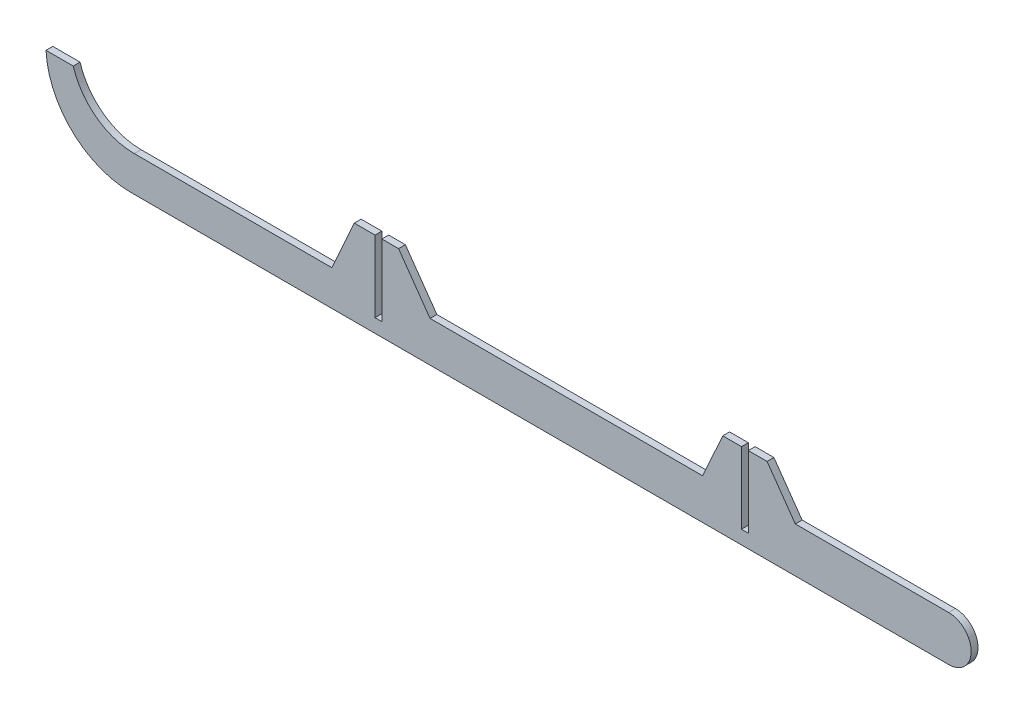
ISO-10303-21;
HEADER;
FILE_DESCRIPTION(('STEP AP214'),'2;1');
FILE_NAME('part.step','',(''),(''),'','','');
FILE_SCHEMA(('AUTOMOTIVE_DESIGN { 1 0 10303 214 1 1 1 1 }'));
ENDSEC;
DATA;
#1=APPLICATION_CONTEXT('core data for automotive mechanical design processes');
#2=APPLICATION_PROTOCOL_DEFINITION('international standard','automotive_design',2000,#1);
#3=PRODUCT_CONTEXT('',#1,'mechanical');
#4=PRODUCT('Part','Part','',(#3));
#5=PRODUCT_RELATED_PRODUCT_CATEGORY('part','',(#4));
#6=PRODUCT_DEFINITION_FORMATION('','',#4);
#7=PRODUCT_DEFINITION_CONTEXT('part definition',#1,'design');
#8=PRODUCT_DEFINITION('design','',#6,#7);
#9=PRODUCT_DEFINITION_SHAPE('','',#8);
#10=(LENGTH_UNIT() NAMED_UNIT(*) SI_UNIT(.MILLI.,.METRE.));
#11=(NAMED_UNIT(*) PLANE_ANGLE_UNIT() SI_UNIT($,.RADIAN.));
#12=(NAMED_UNIT(*) SI_UNIT($,.STERADIAN.) SOLID_ANGLE_UNIT());
#13=UNCERTAINTY_MEASURE_WITH_UNIT(LENGTH_MEASURE(1.E-05),#10,'distance_accuracy_value','');
#14=(GEOMETRIC_REPRESENTATION_CONTEXT(3) GLOBAL_UNCERTAINTY_ASSIGNED_CONTEXT((#13)) GLOBAL_UNIT_ASSIGNED_CONTEXT((#10,
#11,#12)) REPRESENTATION_CONTEXT('',''));
#15=CARTESIAN_POINT('',(0.,0.,0.));
#16=DIRECTION('',(0.,0.,1.));
#17=DIRECTION('',(1.,0.,0.));
#18=AXIS2_PLACEMENT_3D('',#15,#16,#17);
#19=CARTESIAN_POINT('',(78.9077012483061,6.62024351575315,2.));
#20=DIRECTION('',(0.,0.,-1.));
#21=DIRECTION('',(-1.,0.,0.));
#22=AXIS2_PLACEMENT_3D('',#19,#20,#21);
#23=CYLINDRICAL_SURFACE('',#22,6.62024351575315);
#24=CARTESIAN_POINT('',(78.9077012483061,6.62024351575315,0.));
#25=DIRECTION('',(0.,0.,1.));
#26=DIRECTION('',(-1.,0.,0.));
#27=AXIS2_PLACEMENT_3D('',#24,#25,#26);
#28=CIRCLE('',#27,6.62024351575315);
#29=CARTESIAN_POINT('',(78.9077012483061,0.,0.));
#30=VERTEX_POINT('',#29);
#31=CARTESIAN_POINT('',(78.9077012483061,13.2404870315063,0.));
#32=VERTEX_POINT('',#31);
#33=EDGE_CURVE('E216',#30,#32,#28,.T.);
#34=ORIENTED_EDGE('',*,*,#33,.T.);
#35=DIRECTION('',(0.,0.,-1.));
#36=VECTOR('',#35,1.);
#37=CARTESIAN_POINT('',(78.9077012483061,13.2404870315063,2.));
#38=LINE('',#37,#36);
#39=CARTESIAN_POINT('',(78.9077012483061,13.2404870315063,2.));
#40=VERTEX_POINT('',#39);
#41=EDGE_CURVE('E11',#40,#32,#38,.T.);
#42=ORIENTED_EDGE('',*,*,#41,.F.);
#43=CARTESIAN_POINT('',(78.9077012483061,6.62024351575315,2.));
#44=DIRECTION('',(0.,0.,1.));
#45=DIRECTION('',(-1.,0.,0.));
#46=AXIS2_PLACEMENT_3D('',#43,#44,#45);
#47=CIRCLE('',#46,6.62024351575315);
#48=CARTESIAN_POINT('',(78.9077012483061,0.,2.));
#49=VERTEX_POINT('',#48);
#50=EDGE_CURVE('E258',#49,#40,#47,.T.);
#51=ORIENTED_EDGE('',*,*,#50,.F.);
#52=DIRECTION('',(0.,0.,-1.));
#53=VECTOR('',#52,1.);
#54=CARTESIAN_POINT('',(78.9077012483061,0.,2.));
#55=LINE('',#54,#53);
#56=EDGE_CURVE('E212',#49,#30,#55,.T.);
#57=ORIENTED_EDGE('',*,*,#56,.T.);
#58=EDGE_LOOP('',(#34,#42,#51,#57));
#59=FACE_BOUND('',#58,.T.);
#60=ADVANCED_FACE('F36',(#59),#23,.T.);
#61=CARTESIAN_POINT('',(33.9077012483061,13.2404870315063,2.));
#62=DIRECTION('',(0.,-1.,0.));
#63=DIRECTION('',(0.,0.,-1.));
#64=AXIS2_PLACEMENT_3D('',#61,#62,#63);
#65=PLANE('',#64);
#66=DIRECTION('',(-1.,0.,0.));
#67=VECTOR('',#66,1.);
#68=CARTESIAN_POINT('',(33.9077012483061,13.2404870315063,0.));
#69=LINE('',#68,#67);
#70=CARTESIAN_POINT('',(33.9077012483061,13.2404870315063,0.));
#71=VERTEX_POINT('',#70);
#72=EDGE_CURVE('E219',#32,#71,#69,.T.);
#73=ORIENTED_EDGE('',*,*,#72,.T.);
#74=DIRECTION('',(0.,0.,-1.));
#75=VECTOR('',#74,1.);
#76=CARTESIAN_POINT('',(33.9077012483061,13.2404870315063,2.));
#77=LINE('',#76,#75);
#78=CARTESIAN_POINT('',(33.9077012483061,13.2404870315063,2.));
#79=VERTEX_POINT('',#78);
#80=EDGE_CURVE('E44',#79,#71,#77,.T.);
#81=ORIENTED_EDGE('',*,*,#80,.F.);
#82=DIRECTION('',(-1.,0.,0.));
#83=VECTOR('',#82,1.);
#84=CARTESIAN_POINT('',(33.9077012483061,13.2404870315063,2.));
#85=LINE('',#84,#83);
#86=EDGE_CURVE('E137',#40,#79,#85,.T.);
#87=ORIENTED_EDGE('',*,*,#86,.F.);
#88=ORIENTED_EDGE('',*,*,#41,.T.);
#89=EDGE_LOOP('',(#73,#81,#87,#88));
#90=FACE_BOUND('',#89,.T.);
#91=ADVANCED_FACE('F386',(#90),#65,.F.);
#92=CARTESIAN_POINT('',(25.6197937728932,25.,2.));
#93=DIRECTION('',(-0.817390915936502,-0.576083405892313,0.));
#94=DIRECTION('',(0.576083405892313,-0.817390915936502,0.));
#95=AXIS2_PLACEMENT_3D('',#92,#93,#94);
#96=PLANE('',#95);
#97=DIRECTION('',(-0.576083405892313,0.817390915936502,0.));
#98=VECTOR('',#97,1.);
#99=CARTESIAN_POINT('',(25.6197937728932,25.,0.));
#100=LINE('',#99,#98);
#101=CARTESIAN_POINT('',(25.6197937728932,25.,0.));
#102=VERTEX_POINT('',#101);
#103=EDGE_CURVE('E221',#71,#102,#100,.T.);
#104=ORIENTED_EDGE('',*,*,#103,.T.);
#105=DIRECTION('',(0.,0.,-1.));
#106=VECTOR('',#105,1.);
#107=CARTESIAN_POINT('',(25.6197937728932,25.,2.));
#108=LINE('',#107,#106);
#109=CARTESIAN_POINT('',(25.6197937728932,25.,2.));
#110=VERTEX_POINT('',#109);
#111=EDGE_CURVE('E307',#110,#102,#108,.T.);
#112=ORIENTED_EDGE('',*,*,#111,.F.);
#113=DIRECTION('',(-0.576083405892313,0.817390915936502,0.));
#114=VECTOR('',#113,1.);
#115=CARTESIAN_POINT('',(25.6197937728932,25.,2.));
#116=LINE('',#115,#114);
#117=EDGE_CURVE('E315',#79,#110,#116,.T.);
#118=ORIENTED_EDGE('',*,*,#117,.F.);
#119=ORIENTED_EDGE('',*,*,#80,.T.);
#120=EDGE_LOOP('',(#104,#112,#118,#119));
#121=FACE_BOUND('',#120,.T.);
#122=ADVANCED_FACE('F313',(#121),#96,.F.);
#123=CARTESIAN_POINT('',(20.1197937728932,25.,2.));
#124=DIRECTION('',(0.,-1.,0.));
#125=DIRECTION('',(0.,0.,-1.));
#126=AXIS2_PLACEMENT_3D('',#123,#124,#125);
#127=PLANE('',#126);
#128=DIRECTION('',(-1.,0.,0.));
#129=VECTOR('',#128,1.);
#130=CARTESIAN_POINT('',(20.1197937728932,25.,0.));
#131=LINE('',#130,#129);
#132=CARTESIAN_POINT('',(20.1197937728932,25.,0.));
#133=VERTEX_POINT('',#132);
#134=EDGE_CURVE('E223',#102,#133,#131,.T.);
#135=ORIENTED_EDGE('',*,*,#134,.T.);
#136=DIRECTION('',(0.,0.,-1.));
#137=VECTOR('',#136,1.);
#138=CARTESIAN_POINT('',(20.1197937728932,25.,2.));
#139=LINE('',#138,#137);
#140=CARTESIAN_POINT('',(20.1197937728932,25.,2.));
#141=VERTEX_POINT('',#140);
#142=EDGE_CURVE('E304',#141,#133,#139,.T.);
#143=ORIENTED_EDGE('',*,*,#142,.F.);
#144=DIRECTION('',(-1.,0.,0.));
#145=VECTOR('',#144,1.);
#146=CARTESIAN_POINT('',(20.1197937728932,25.,2.));
#147=LINE('',#146,#145);
#148=EDGE_CURVE('E333',#110,#141,#147,.T.);
#149=ORIENTED_EDGE('',*,*,#148,.F.);
#150=ORIENTED_EDGE('',*,*,#111,.T.);
#151=EDGE_LOOP('',(#135,#143,#149,#150));
#152=FACE_BOUND('',#151,.T.);
#153=ADVANCED_FACE('F324',(#152),#127,.F.);
#154=CARTESIAN_POINT('',(20.1197937728932,25.,2.));
#155=DIRECTION('',(1.,0.,0.));
#156=DIRECTION('',(0.,1.,0.));
#157=AXIS2_PLACEMENT_3D('',#154,#155,#156);
#158=PLANE('',#157);
#159=DIRECTION('',(0.,-1.,0.));
#160=VECTOR('',#159,1.);
#161=CARTESIAN_POINT('',(20.1197937728932,25.,0.));
#162=LINE('',#161,#160);
#163=CARTESIAN_POINT('',(20.1197937728933,4.,0.));
#164=VERTEX_POINT('',#163);
#165=EDGE_CURVE('E225',#133,#164,#162,.T.);
#166=ORIENTED_EDGE('',*,*,#165,.T.);
#167=DIRECTION('',(0.,0.,-1.));
#168=VECTOR('',#167,1.);
#169=CARTESIAN_POINT('',(20.1197937728933,4.,2.));
#170=LINE('',#169,#168);
#171=CARTESIAN_POINT('',(20.1197937728933,4.,2.));
#172=VERTEX_POINT('',#171);
#173=EDGE_CURVE('E301',#172,#164,#170,.T.);
#174=ORIENTED_EDGE('',*,*,#173,.F.);
#175=DIRECTION('',(0.,-1.,0.));
#176=VECTOR('',#175,1.);
#177=CARTESIAN_POINT('',(20.1197937728932,25.,2.));
#178=LINE('',#177,#176);
#179=EDGE_CURVE('E330',#141,#172,#178,.T.);
#180=ORIENTED_EDGE('',*,*,#179,.F.);
#181=ORIENTED_EDGE('',*,*,#142,.T.);
#182=EDGE_LOOP('',(#166,#174,#180,#181));
#183=FACE_BOUND('',#182,.T.);
#184=ADVANCED_FACE('F328',(#183),#158,.F.);
#185=CARTESIAN_POINT('',(18.1197937728933,3.99999999999999,2.));
#186=DIRECTION('',(0.,-1.,0.));
#187=DIRECTION('',(1.,0.,0.));
#188=AXIS2_PLACEMENT_3D('',#185,#186,#187);
#189=PLANE('',#188);
#190=DIRECTION('',(-1.,0.,0.));
#191=VECTOR('',#190,1.);
#192=CARTESIAN_POINT('',(18.1197937728933,3.99999999999999,0.));
#193=LINE('',#192,#191);
#194=CARTESIAN_POINT('',(18.1197937728933,3.99999999999999,0.));
#195=VERTEX_POINT('',#194);
#196=EDGE_CURVE('E227',#164,#195,#193,.T.);
#197=ORIENTED_EDGE('',*,*,#196,.T.);
#198=DIRECTION('',(0.,0.,-1.));
#199=VECTOR('',#198,1.);
#200=CARTESIAN_POINT('',(18.1197937728933,3.99999999999999,2.));
#201=LINE('',#200,#199);
#202=CARTESIAN_POINT('',(18.1197937728933,3.99999999999999,2.));
#203=VERTEX_POINT('',#202);
#204=EDGE_CURVE('E298',#203,#195,#201,.T.);
#205=ORIENTED_EDGE('',*,*,#204,.F.);
#206=DIRECTION('',(-1.,0.,0.));
#207=VECTOR('',#206,1.);
#208=CARTESIAN_POINT('',(18.1197937728933,3.99999999999999,2.));
#209=LINE('',#208,#207);
#210=EDGE_CURVE('E332',#172,#203,#209,.T.);
#211=ORIENTED_EDGE('',*,*,#210,.F.);
#212=ORIENTED_EDGE('',*,*,#173,.T.);
#213=EDGE_LOOP('',(#197,#205,#211,#212));
#214=FACE_BOUND('',#213,.T.);
#215=ADVANCED_FACE('F399',(#214),#189,.F.);
#216=CARTESIAN_POINT('',(18.1197937728932,25.,2.));
#217=DIRECTION('',(-1.,0.,0.));
#218=DIRECTION('',(0.,-1.,0.));
#219=AXIS2_PLACEMENT_3D('',#216,#217,#218);
#220=PLANE('',#219);
#221=DIRECTION('',(0.,1.,0.));
#222=VECTOR('',#221,1.);
#223=CARTESIAN_POINT('',(18.1197937728932,25.,0.));
#224=LINE('',#223,#222);
#225=CARTESIAN_POINT('',(18.1197937728932,25.,0.));
#226=VERTEX_POINT('',#225);
#227=EDGE_CURVE('E229',#195,#226,#224,.T.);
#228=ORIENTED_EDGE('',*,*,#227,.T.);
#229=DIRECTION('',(0.,0.,-1.));
#230=VECTOR('',#229,1.);
#231=CARTESIAN_POINT('',(18.1197937728932,25.,2.));
#232=LINE('',#231,#230);
#233=CARTESIAN_POINT('',(18.1197937728932,25.,2.));
#234=VERTEX_POINT('',#233);
#235=EDGE_CURVE('E295',#234,#226,#232,.T.);
#236=ORIENTED_EDGE('',*,*,#235,.F.);
#237=DIRECTION('',(0.,1.,0.));
#238=VECTOR('',#237,1.);
#239=CARTESIAN_POINT('',(18.1197937728932,25.,2.));
#240=LINE('',#239,#238);
#241=EDGE_CURVE('E335',#203,#234,#240,.T.);
#242=ORIENTED_EDGE('',*,*,#241,.F.);
#243=ORIENTED_EDGE('',*,*,#204,.T.);
#244=EDGE_LOOP('',(#228,#236,#242,#243));
#245=FACE_BOUND('',#244,.T.);
#246=ADVANCED_FACE('F402',(#245),#220,.F.);
#247=CARTESIAN_POINT('',(12.6197937728932,25.,2.));
#248=DIRECTION('',(0.,-1.,0.));
#249=DIRECTION('',(1.,0.,0.));
#250=AXIS2_PLACEMENT_3D('',#247,#248,#249);
#251=PLANE('',#250);
#252=DIRECTION('',(-1.,0.,0.));
#253=VECTOR('',#252,1.);
#254=CARTESIAN_POINT('',(12.6197937728932,25.,0.));
#255=LINE('',#254,#253);
#256=CARTESIAN_POINT('',(12.6197937728932,25.,0.));
#257=VERTEX_POINT('',#256);
#258=EDGE_CURVE('E231',#226,#257,#255,.T.);
#259=ORIENTED_EDGE('',*,*,#258,.T.);
#260=DIRECTION('',(0.,0.,-1.));
#261=VECTOR('',#260,1.);
#262=CARTESIAN_POINT('',(12.6197937728932,25.,2.));
#263=LINE('',#262,#261);
#264=CARTESIAN_POINT('',(12.6197937728932,25.,2.));
#265=VERTEX_POINT('',#264);
#266=EDGE_CURVE('E292',#265,#257,#263,.T.);
#267=ORIENTED_EDGE('',*,*,#266,.F.);
#268=DIRECTION('',(-1.,0.,0.));
#269=VECTOR('',#268,1.);
#270=CARTESIAN_POINT('',(12.6197937728932,25.,2.));
#271=LINE('',#270,#269);
#272=EDGE_CURVE('E341',#234,#265,#271,.T.);
#273=ORIENTED_EDGE('',*,*,#272,.F.);
#274=ORIENTED_EDGE('',*,*,#235,.T.);
#275=EDGE_LOOP('',(#259,#267,#273,#274));
#276=FACE_BOUND('',#275,.T.);
#277=ADVANCED_FACE('F406',(#276),#251,.F.);
#278=CARTESIAN_POINT('',(6.70858366626772,11.8838591555098,2.));
#279=DIRECTION('',(0.911688639415078,-0.410881764941551,0.));
#280=DIRECTION('',(0.410881764941551,0.911688639415078,0.));
#281=AXIS2_PLACEMENT_3D('',#278,#279,#280);
#282=PLANE('',#281);
#283=DIRECTION('',(-0.410881764941551,-0.911688639415078,0.));
#284=VECTOR('',#283,1.);
#285=CARTESIAN_POINT('',(6.70858366626772,11.8838591555098,0.));
#286=LINE('',#285,#284);
#287=CARTESIAN_POINT('',(6.70858366626772,11.8838591555098,0.));
#288=VERTEX_POINT('',#287);
#289=EDGE_CURVE('E233',#257,#288,#286,.T.);
#290=ORIENTED_EDGE('',*,*,#289,.T.);
#291=DIRECTION('',(0.,0.,-1.));
#292=VECTOR('',#291,1.);
#293=CARTESIAN_POINT('',(6.70858366626772,11.8838591555098,2.));
#294=LINE('',#293,#292);
#295=CARTESIAN_POINT('',(6.70858366626772,11.8838591555098,2.));
#296=VERTEX_POINT('',#295);
#297=EDGE_CURVE('E289',#296,#288,#294,.T.);
#298=ORIENTED_EDGE('',*,*,#297,.F.);
#299=DIRECTION('',(-0.410881764941551,-0.911688639415078,0.));
#300=VECTOR('',#299,1.);
#301=CARTESIAN_POINT('',(6.70858366626772,11.8838591555098,2.));
#302=LINE('',#301,#300);
#303=EDGE_CURVE('E343',#265,#296,#302,.T.);
#304=ORIENTED_EDGE('',*,*,#303,.F.);
#305=ORIENTED_EDGE('',*,*,#266,.T.);
#306=EDGE_LOOP('',(#290,#298,#304,#305));
#307=FACE_BOUND('',#306,.T.);
#308=ADVANCED_FACE('F410',(#307),#282,.F.);
#309=CARTESIAN_POINT('',(-73.2914163337323,11.8838591555098,2.));
#310=DIRECTION('',(0.,-1.,0.));
#311=DIRECTION('',(1.,0.,0.));
#312=AXIS2_PLACEMENT_3D('',#309,#310,#311);
#313=PLANE('',#312);
#314=DIRECTION('',(-1.,0.,0.));
#315=VECTOR('',#314,1.);
#316=CARTESIAN_POINT('',(-73.2914163337323,11.8838591555098,0.));
#317=LINE('',#316,#315);
#318=CARTESIAN_POINT('',(-73.2914163337323,11.8838591555098,0.));
#319=VERTEX_POINT('',#318);
#320=EDGE_CURVE('E235',#288,#319,#317,.T.);
#321=ORIENTED_EDGE('',*,*,#320,.T.);
#322=DIRECTION('',(0.,0.,-1.));
#323=VECTOR('',#322,1.);
#324=CARTESIAN_POINT('',(-73.2914163337323,11.8838591555098,2.));
#325=LINE('',#324,#323);
#326=CARTESIAN_POINT('',(-73.2914163337323,11.8838591555098,2.));
#327=VERTEX_POINT('',#326);
#328=EDGE_CURVE('E286',#327,#319,#325,.T.);
#329=ORIENTED_EDGE('',*,*,#328,.F.);
#330=DIRECTION('',(-1.,0.,0.));
#331=VECTOR('',#330,1.);
#332=CARTESIAN_POINT('',(-73.2914163337323,11.8838591555098,2.));
#333=LINE('',#332,#331);
#334=EDGE_CURVE('E345',#296,#327,#333,.T.);
#335=ORIENTED_EDGE('',*,*,#334,.F.);
#336=ORIENTED_EDGE('',*,*,#297,.T.);
#337=EDGE_LOOP('',(#321,#329,#335,#336));
#338=FACE_BOUND('',#337,.T.);
#339=ADVANCED_FACE('F414',(#338),#313,.F.);
#340=CARTESIAN_POINT('',(-82.5354523788357,25.,2.));
#341=DIRECTION('',(-0.817390915936502,-0.576083405892313,0.));
#342=DIRECTION('',(0.576083405892313,-0.817390915936502,0.));
#343=AXIS2_PLACEMENT_3D('',#340,#341,#342);
#344=PLANE('',#343);
#345=DIRECTION('',(-0.576083405892313,0.817390915936502,0.));
#346=VECTOR('',#345,1.);
#347=CARTESIAN_POINT('',(-82.5354523788357,25.,0.));
#348=LINE('',#347,#346);
#349=CARTESIAN_POINT('',(-82.5354523788357,25.,0.));
#350=VERTEX_POINT('',#349);
#351=EDGE_CURVE('E237',#319,#350,#348,.T.);
#352=ORIENTED_EDGE('',*,*,#351,.T.);
#353=DIRECTION('',(0.,0.,-1.));
#354=VECTOR('',#353,1.);
#355=CARTESIAN_POINT('',(-82.5354523788357,25.,2.));
#356=LINE('',#355,#354);
#357=CARTESIAN_POINT('',(-82.5354523788357,25.,2.));
#358=VERTEX_POINT('',#357);
#359=EDGE_CURVE('E283',#358,#350,#356,.T.);
#360=ORIENTED_EDGE('',*,*,#359,.F.);
#361=DIRECTION('',(-0.576083405892313,0.817390915936502,0.));
#362=VECTOR('',#361,1.);
#363=CARTESIAN_POINT('',(-82.5354523788357,25.,2.));
#364=LINE('',#363,#362);
#365=EDGE_CURVE('E347',#327,#358,#364,.T.);
#366=ORIENTED_EDGE('',*,*,#365,.F.);
#367=ORIENTED_EDGE('',*,*,#328,.T.);
#368=EDGE_LOOP('',(#352,#360,#366,#367));
#369=FACE_BOUND('',#368,.T.);
#370=ADVANCED_FACE('F418',(#369),#344,.F.);
#371=CARTESIAN_POINT('',(-82.5354523788357,25.,2.));
#372=DIRECTION('',(0.,-1.,0.));
#373=DIRECTION('',(0.,0.,-1.));
#374=AXIS2_PLACEMENT_3D('',#371,#372,#373);
#375=PLANE('',#374);
#376=DIRECTION('',(-1.,0.,0.));
#377=VECTOR('',#376,1.);
#378=CARTESIAN_POINT('',(-82.5354523788357,25.,0.));
#379=LINE('',#378,#377);
#380=CARTESIAN_POINT('',(-87.4420084974407,25.,0.));
#381=VERTEX_POINT('',#380);
#382=EDGE_CURVE('E239',#350,#381,#379,.T.);
#383=ORIENTED_EDGE('',*,*,#382,.T.);
#384=DIRECTION('',(0.,0.,-1.));
#385=VECTOR('',#384,1.);
#386=CARTESIAN_POINT('',(-87.4420084974407,25.,2.));
#387=LINE('',#386,#385);
#388=CARTESIAN_POINT('',(-87.4420084974407,25.,2.));
#389=VERTEX_POINT('',#388);
#390=EDGE_CURVE('E280',#389,#381,#387,.T.);
#391=ORIENTED_EDGE('',*,*,#390,.F.);
#392=DIRECTION('',(-1.,0.,0.));
#393=VECTOR('',#392,1.);
#394=CARTESIAN_POINT('',(-82.5354523788357,25.,2.));
#395=LINE('',#394,#393);
#396=EDGE_CURVE('E349',#358,#389,#395,.T.);
#397=ORIENTED_EDGE('',*,*,#396,.F.);
#398=ORIENTED_EDGE('',*,*,#359,.T.);
#399=EDGE_LOOP('',(#383,#391,#397,#398));
#400=FACE_BOUND('',#399,.T.);
#401=ADVANCED_FACE('F422',(#400),#375,.F.);
#402=CARTESIAN_POINT('',(-87.4420084974407,25.,2.));
#403=DIRECTION('',(1.,0.,0.));
#404=DIRECTION('',(0.,0.,-1.));
#405=AXIS2_PLACEMENT_3D('',#402,#403,#404);
#406=PLANE('',#405);
#407=DIRECTION('',(0.,-1.,0.));
#408=VECTOR('',#407,1.);
#409=CARTESIAN_POINT('',(-87.4420084974407,25.,0.));
#410=LINE('',#409,#408);
#411=CARTESIAN_POINT('',(-87.4420084974407,3.99999999999998,0.));
#412=VERTEX_POINT('',#411);
#413=EDGE_CURVE('E241',#381,#412,#410,.T.);
#414=ORIENTED_EDGE('',*,*,#413,.T.);
#415=DIRECTION('',(0.,0.,-1.));
#416=VECTOR('',#415,1.);
#417=CARTESIAN_POINT('',(-87.4420084974407,3.99999999999998,2.));
#418=LINE('',#417,#416);
#419=CARTESIAN_POINT('',(-87.4420084974407,3.99999999999998,2.));
#420=VERTEX_POINT('',#419);
#421=EDGE_CURVE('E277',#420,#412,#418,.T.);
#422=ORIENTED_EDGE('',*,*,#421,.F.);
#423=DIRECTION('',(0.,-1.,0.));
#424=VECTOR('',#423,1.);
#425=CARTESIAN_POINT('',(-87.4420084974407,25.,2.));
#426=LINE('',#425,#424);
#427=EDGE_CURVE('E351',#389,#420,#426,.T.);
#428=ORIENTED_EDGE('',*,*,#427,.F.);
#429=ORIENTED_EDGE('',*,*,#390,.T.);
#430=EDGE_LOOP('',(#414,#422,#428,#429));
#431=FACE_BOUND('',#430,.T.);
#432=ADVANCED_FACE('F426',(#431),#406,.F.);
#433=CARTESIAN_POINT('',(-89.4420084974407,3.99999999999998,2.));
#434=DIRECTION('',(0.,-1.,0.));
#435=DIRECTION('',(1.,0.,0.));
#436=AXIS2_PLACEMENT_3D('',#433,#434,#435);
#437=PLANE('',#436);
#438=DIRECTION('',(-1.,0.,0.));
#439=VECTOR('',#438,1.);
#440=CARTESIAN_POINT('',(-89.4420084974407,3.99999999999998,0.));
#441=LINE('',#440,#439);
#442=CARTESIAN_POINT('',(-89.4420084974407,3.99999999999998,0.));
#443=VERTEX_POINT('',#442);
#444=EDGE_CURVE('E243',#412,#443,#441,.T.);
#445=ORIENTED_EDGE('',*,*,#444,.T.);
#446=DIRECTION('',(0.,0.,-1.));
#447=VECTOR('',#446,1.);
#448=CARTESIAN_POINT('',(-89.4420084974407,3.99999999999998,2.));
#449=LINE('',#448,#447);
#450=CARTESIAN_POINT('',(-89.4420084974407,3.99999999999998,2.));
#451=VERTEX_POINT('',#450);
#452=EDGE_CURVE('E274',#451,#443,#449,.T.);
#453=ORIENTED_EDGE('',*,*,#452,.F.);
#454=DIRECTION('',(-1.,0.,0.));
#455=VECTOR('',#454,1.);
#456=CARTESIAN_POINT('',(-89.4420084974407,3.99999999999998,2.));
#457=LINE('',#456,#455);
#458=EDGE_CURVE('E353',#420,#451,#457,.T.);
#459=ORIENTED_EDGE('',*,*,#458,.F.);
#460=ORIENTED_EDGE('',*,*,#421,.T.);
#461=EDGE_LOOP('',(#445,#453,#459,#460));
#462=FACE_BOUND('',#461,.T.);
#463=ADVANCED_FACE('F430',(#462),#437,.F.);
#464=CARTESIAN_POINT('',(-89.4420084974407,25.,2.));
#465=DIRECTION('',(-1.,0.,0.));
#466=DIRECTION('',(0.,0.,1.));
#467=AXIS2_PLACEMENT_3D('',#464,#465,#466);
#468=PLANE('',#467);
#469=DIRECTION('',(0.,1.,0.));
#470=VECTOR('',#469,1.);
#471=CARTESIAN_POINT('',(-89.4420084974407,25.,0.));
#472=LINE('',#471,#470);
#473=CARTESIAN_POINT('',(-89.4420084974407,25.,0.));
#474=VERTEX_POINT('',#473);
#475=EDGE_CURVE('E245',#443,#474,#472,.T.);
#476=ORIENTED_EDGE('',*,*,#475,.T.);
#477=DIRECTION('',(0.,0.,-1.));
#478=VECTOR('',#477,1.);
#479=CARTESIAN_POINT('',(-89.4420084974407,25.,2.));
#480=LINE('',#479,#478);
#481=CARTESIAN_POINT('',(-89.4420084974407,25.,2.));
#482=VERTEX_POINT('',#481);
#483=EDGE_CURVE('E271',#482,#474,#480,.T.);
#484=ORIENTED_EDGE('',*,*,#483,.F.);
#485=DIRECTION('',(0.,1.,0.));
#486=VECTOR('',#485,1.);
#487=CARTESIAN_POINT('',(-89.4420084974407,25.,2.));
#488=LINE('',#487,#486);
#489=EDGE_CURVE('E355',#451,#482,#488,.T.);
#490=ORIENTED_EDGE('',*,*,#489,.F.);
#491=ORIENTED_EDGE('',*,*,#452,.T.);
#492=EDGE_LOOP('',(#476,#484,#490,#491));
#493=FACE_BOUND('',#492,.T.);
#494=ADVANCED_FACE('F434',(#493),#468,.F.);
#495=CARTESIAN_POINT('',(-89.4420084974407,25.,2.));
#496=DIRECTION('',(0.,-1.,0.));
#497=DIRECTION('',(0.,0.,-1.));
#498=AXIS2_PLACEMENT_3D('',#495,#496,#497);
#499=PLANE('',#498);
#500=DIRECTION('',(-1.,0.,0.));
#501=VECTOR('',#500,1.);
#502=CARTESIAN_POINT('',(-89.4420084974407,25.,0.));
#503=LINE('',#502,#501);
#504=CARTESIAN_POINT('',(-95.5354523788357,25.,0.));
#505=VERTEX_POINT('',#504);
#506=EDGE_CURVE('E247',#474,#505,#503,.T.);
#507=ORIENTED_EDGE('',*,*,#506,.T.);
#508=DIRECTION('',(0.,0.,-1.));
#509=VECTOR('',#508,1.);
#510=CARTESIAN_POINT('',(-95.5354523788357,25.,2.));
#511=LINE('',#510,#509);
#512=CARTESIAN_POINT('',(-95.5354523788357,25.,2.));
#513=VERTEX_POINT('',#512);
#514=EDGE_CURVE('E268',#513,#505,#511,.T.);
#515=ORIENTED_EDGE('',*,*,#514,.F.);
#516=DIRECTION('',(-1.,0.,0.));
#517=VECTOR('',#516,1.);
#518=CARTESIAN_POINT('',(-89.4420084974407,25.,2.));
#519=LINE('',#518,#517);
#520=EDGE_CURVE('E357',#482,#513,#519,.T.);
#521=ORIENTED_EDGE('',*,*,#520,.F.);
#522=ORIENTED_EDGE('',*,*,#483,.T.);
#523=EDGE_LOOP('',(#507,#515,#521,#522));
#524=FACE_BOUND('',#523,.T.);
#525=ADVANCED_FACE('F438',(#524),#499,.F.);
#526=CARTESIAN_POINT('',(-102.128605048304,10.3707248664619,2.));
#527=DIRECTION('',(0.911688639415077,-0.410881764941553,0.));
#528=DIRECTION('',(0.410881764941553,0.911688639415077,0.));
#529=AXIS2_PLACEMENT_3D('',#526,#527,#528);
#530=PLANE('',#529);
#531=DIRECTION('',(-0.410881764941553,-0.911688639415077,0.));
#532=VECTOR('',#531,1.);
#533=CARTESIAN_POINT('',(-102.128605048304,10.3707248664619,0.));
#534=LINE('',#533,#532);
#535=CARTESIAN_POINT('',(-102.128605048304,10.3707248664619,0.));
#536=VERTEX_POINT('',#535);
#537=EDGE_CURVE('E249',#505,#536,#534,.T.);
#538=ORIENTED_EDGE('',*,*,#537,.T.);
#539=DIRECTION('',(0.,0.,-1.));
#540=VECTOR('',#539,1.);
#541=CARTESIAN_POINT('',(-102.128605048304,10.3707248664619,2.));
#542=LINE('',#541,#540);
#543=CARTESIAN_POINT('',(-102.128605048304,10.3707248664619,2.));
#544=VERTEX_POINT('',#543);
#545=EDGE_CURVE('E265',#544,#536,#542,.T.);
#546=ORIENTED_EDGE('',*,*,#545,.F.);
#547=DIRECTION('',(-0.410881764941553,-0.911688639415077,0.));
#548=VECTOR('',#547,1.);
#549=CARTESIAN_POINT('',(-102.128605048304,10.3707248664619,2.));
#550=LINE('',#549,#548);
#551=EDGE_CURVE('E359',#513,#544,#550,.T.);
#552=ORIENTED_EDGE('',*,*,#551,.F.);
#553=ORIENTED_EDGE('',*,*,#514,.T.);
#554=EDGE_LOOP('',(#538,#546,#552,#553));
#555=FACE_BOUND('',#554,.T.);
#556=ADVANCED_FACE('F442',(#555),#530,.F.);
#557=CARTESIAN_POINT('',(-102.128605048304,10.3707248664619,2.));
#558=DIRECTION('',(0.,-1.,0.));
#559=DIRECTION('',(1.,0.,0.));
#560=AXIS2_PLACEMENT_3D('',#557,#558,#559);
#561=PLANE('',#560);
#562=DIRECTION('',(-1.,0.,0.));
#563=VECTOR('',#562,1.);
#564=CARTESIAN_POINT('',(-102.128605048304,10.3707248664619,0.));
#565=LINE('',#564,#563);
#566=CARTESIAN_POINT('',(-160.128605048304,10.3707248664619,0.));
#567=VERTEX_POINT('',#566);
#568=EDGE_CURVE('E251',#536,#567,#565,.T.);
#569=ORIENTED_EDGE('',*,*,#568,.T.);
#570=DIRECTION('',(0.,0.,-1.));
#571=VECTOR('',#570,1.);
#572=CARTESIAN_POINT('',(-160.128605048304,10.3707248664619,2.));
#573=LINE('',#572,#571);
#574=CARTESIAN_POINT('',(-160.128605048304,10.3707248664619,2.));
#575=VERTEX_POINT('',#574);
#576=EDGE_CURVE('E262',#575,#567,#573,.T.);
#577=ORIENTED_EDGE('',*,*,#576,.F.);
#578=DIRECTION('',(-1.,0.,0.));
#579=VECTOR('',#578,1.);
#580=CARTESIAN_POINT('',(-102.128605048304,10.3707248664619,2.));
#581=LINE('',#580,#579);
#582=EDGE_CURVE('E361',#544,#575,#581,.T.);
#583=ORIENTED_EDGE('',*,*,#582,.F.);
#584=ORIENTED_EDGE('',*,*,#545,.T.);
#585=EDGE_LOOP('',(#569,#577,#583,#584));
#586=FACE_BOUND('',#585,.T.);
#587=ADVANCED_FACE('F367',(#586),#561,.F.);
#588=CARTESIAN_POINT('',(-160.128605048304,29.0462645029168,2.));
#589=DIRECTION('',(0.,0.,-1.));
#590=DIRECTION('',(-1.,0.,0.));
#591=AXIS2_PLACEMENT_3D('',#588,#589,#590);
#592=CYLINDRICAL_SURFACE('',#591,18.6755396364549);
#593=CARTESIAN_POINT('',(-160.128605048304,29.0462645029168,0.));
#594=DIRECTION('',(0.,0.,-1.));
#595=DIRECTION('',(-1.,0.,0.));
#596=AXIS2_PLACEMENT_3D('',#593,#594,#595);
#597=CIRCLE('',#596,18.6755396364549);
#598=CARTESIAN_POINT('',(-178.01396586402,23.6713552753602,0.));
#599=VERTEX_POINT('',#598);
#600=EDGE_CURVE('E253',#567,#599,#597,.T.);
#601=ORIENTED_EDGE('',*,*,#600,.T.);
#602=DIRECTION('',(0.,0.,-1.));
#603=VECTOR('',#602,1.);
#604=CARTESIAN_POINT('',(-178.01396586402,23.6713552753602,2.));
#605=LINE('',#604,#603);
#606=CARTESIAN_POINT('',(-178.01396586402,23.6713552753602,2.));
#607=VERTEX_POINT('',#606);
#608=EDGE_CURVE('E207',#607,#599,#605,.T.);
#609=ORIENTED_EDGE('',*,*,#608,.F.);
#610=CARTESIAN_POINT('',(-160.128605048304,29.0462645029168,2.));
#611=DIRECTION('',(0.,0.,-1.));
#612=DIRECTION('',(-1.,0.,0.));
#613=AXIS2_PLACEMENT_3D('',#610,#611,#612);
#614=CIRCLE('',#613,18.6755396364549);
#615=EDGE_CURVE('E198',#575,#607,#614,.T.);
#616=ORIENTED_EDGE('',*,*,#615,.F.);
#617=ORIENTED_EDGE('',*,*,#576,.T.);
#618=EDGE_LOOP('',(#601,#609,#616,#617));
#619=FACE_BOUND('',#618,.T.);
#620=ADVANCED_FACE('F371',(#619),#592,.F.);
#621=CARTESIAN_POINT('',(-186.01396586402,23.6713552753602,2.));
#622=DIRECTION('',(0.,-1.,0.));
#623=DIRECTION('',(1.,0.,0.));
#624=AXIS2_PLACEMENT_3D('',#621,#622,#623);
#625=PLANE('',#624);
#626=DIRECTION('',(-1.,0.,0.));
#627=VECTOR('',#626,1.);
#628=CARTESIAN_POINT('',(-186.01396586402,23.6713552753602,0.));
#629=LINE('',#628,#627);
#630=CARTESIAN_POINT('',(-186.01396586402,23.6713552753602,0.));
#631=VERTEX_POINT('',#630);
#632=EDGE_CURVE('E206',#599,#631,#629,.T.);
#633=ORIENTED_EDGE('',*,*,#632,.T.);
#634=DIRECTION('',(0.,0.,-1.));
#635=VECTOR('',#634,1.);
#636=CARTESIAN_POINT('',(-186.01396586402,23.6713552753602,2.));
#637=LINE('',#636,#635);
#638=CARTESIAN_POINT('',(-186.01396586402,23.6713552753602,2.));
#639=VERTEX_POINT('',#638);
#640=EDGE_CURVE('E203',#639,#631,#637,.T.);
#641=ORIENTED_EDGE('',*,*,#640,.F.);
#642=DIRECTION('',(-1.,0.,0.));
#643=VECTOR('',#642,1.);
#644=CARTESIAN_POINT('',(-186.01396586402,23.6713552753602,2.));
#645=LINE('',#644,#643);
#646=EDGE_CURVE('E192',#607,#639,#645,.T.);
#647=ORIENTED_EDGE('',*,*,#646,.F.);
#648=ORIENTED_EDGE('',*,*,#608,.T.);
#649=EDGE_LOOP('',(#633,#641,#647,#648));
#650=FACE_BOUND('',#649,.T.);
#651=ADVANCED_FACE('F204',(#650),#625,.F.);
#652=CARTESIAN_POINT('',(-161.092298751694,24.954687606325,2.));
#653=DIRECTION('',(0.,0.,-1.));
#654=DIRECTION('',(-1.,0.,0.));
#655=AXIS2_PLACEMENT_3D('',#652,#653,#654);
#656=CYLINDRICAL_SURFACE('',#655,24.9546876063251);
#657=CARTESIAN_POINT('',(-161.092298751694,24.954687606325,0.));
#658=DIRECTION('',(0.,0.,1.));
#659=DIRECTION('',(-1.,0.,0.));
#660=AXIS2_PLACEMENT_3D('',#657,#658,#659);
#661=CIRCLE('',#660,24.9546876063251);
#662=CARTESIAN_POINT('',(-161.092298751694,0.,0.));
#663=VERTEX_POINT('',#662);
#664=EDGE_CURVE('E123',#631,#663,#661,.T.);
#665=ORIENTED_EDGE('',*,*,#664,.T.);
#666=DIRECTION('',(0.,0.,-1.));
#667=VECTOR('',#666,1.);
#668=CARTESIAN_POINT('',(-161.092298751694,0.,2.));
#669=LINE('',#668,#667);
#670=CARTESIAN_POINT('',(-161.092298751694,0.,2.));
#671=VERTEX_POINT('',#670);
#672=EDGE_CURVE('E208',#671,#663,#669,.T.);
#673=ORIENTED_EDGE('',*,*,#672,.F.);
#674=CARTESIAN_POINT('',(-161.092298751694,24.954687606325,2.));
#675=DIRECTION('',(0.,0.,1.));
#676=DIRECTION('',(-1.,0.,0.));
#677=AXIS2_PLACEMENT_3D('',#674,#675,#676);
#678=CIRCLE('',#677,24.9546876063251);
#679=EDGE_CURVE('E196',#639,#671,#678,.T.);
#680=ORIENTED_EDGE('',*,*,#679,.F.);
#681=ORIENTED_EDGE('',*,*,#640,.T.);
#682=EDGE_LOOP('',(#665,#673,#680,#681));
#683=FACE_BOUND('',#682,.T.);
#684=ADVANCED_FACE('F210',(#683),#656,.T.);
#685=CARTESIAN_POINT('',(78.9077012483061,0.,2.));
#686=DIRECTION('',(0.,1.,0.));
#687=DIRECTION('',(-1.,0.,0.));
#688=AXIS2_PLACEMENT_3D('',#685,#686,#687);
#689=PLANE('',#688);
#690=DIRECTION('',(1.,0.,0.));
#691=VECTOR('',#690,1.);
#692=CARTESIAN_POINT('',(78.9077012483061,0.,0.));
#693=LINE('',#692,#691);
#694=EDGE_CURVE('E129',#663,#30,#693,.T.);
#695=ORIENTED_EDGE('',*,*,#694,.T.);
#696=ORIENTED_EDGE('',*,*,#56,.F.);
#697=DIRECTION('',(1.,0.,0.));
#698=VECTOR('',#697,1.);
#699=CARTESIAN_POINT('',(78.9077012483061,0.,2.));
#700=LINE('',#699,#698);
#701=EDGE_CURVE('E52',#671,#49,#700,.T.);
#702=ORIENTED_EDGE('',*,*,#701,.F.);
#703=ORIENTED_EDGE('',*,*,#672,.T.);
#704=EDGE_LOOP('',(#695,#696,#702,#703));
#705=FACE_BOUND('',#704,.T.);
#706=ADVANCED_FACE('F375',(#705),#689,.F.);
#707=CARTESIAN_POINT('',(78.9077012483061,6.62024351575315,2.));
#708=DIRECTION('',(0.,0.,-1.));
#709=DIRECTION('',(-1.,0.,0.));
#710=AXIS2_PLACEMENT_3D('',#707,#708,#709);
#711=PLANE('',#710);
#712=ORIENTED_EDGE('',*,*,#50,.T.);
#713=ORIENTED_EDGE('',*,*,#86,.T.);
#714=ORIENTED_EDGE('',*,*,#117,.T.);
#715=ORIENTED_EDGE('',*,*,#148,.T.);
#716=ORIENTED_EDGE('',*,*,#179,.T.);
#717=ORIENTED_EDGE('',*,*,#210,.T.);
#718=ORIENTED_EDGE('',*,*,#241,.T.);
#719=ORIENTED_EDGE('',*,*,#272,.T.);
#720=ORIENTED_EDGE('',*,*,#303,.T.);
#721=ORIENTED_EDGE('',*,*,#334,.T.);
#722=ORIENTED_EDGE('',*,*,#365,.T.);
#723=ORIENTED_EDGE('',*,*,#396,.T.);
#724=ORIENTED_EDGE('',*,*,#427,.T.);
#725=ORIENTED_EDGE('',*,*,#458,.T.);
#726=ORIENTED_EDGE('',*,*,#489,.T.);
#727=ORIENTED_EDGE('',*,*,#520,.T.);
#728=ORIENTED_EDGE('',*,*,#551,.T.);
#729=ORIENTED_EDGE('',*,*,#582,.T.);
#730=ORIENTED_EDGE('',*,*,#615,.T.);
#731=ORIENTED_EDGE('',*,*,#646,.T.);
#732=ORIENTED_EDGE('',*,*,#679,.T.);
#733=ORIENTED_EDGE('',*,*,#701,.T.);
#734=EDGE_LOOP('',(#712,#713,#714,#715,#716,#717,#718,#719,#720,#721,#722,#723,#724,#725,#726,
#727,#728,#729,#730,#731,#732,#733));
#735=FACE_BOUND('',#734,.T.);
#736=ADVANCED_FACE('F194',(#735),#711,.F.);
#737=CARTESIAN_POINT('',(78.9077012483061,6.62024351575315,0.));
#738=DIRECTION('',(0.,0.,-1.));
#739=DIRECTION('',(-1.,0.,0.));
#740=AXIS2_PLACEMENT_3D('',#737,#738,#739);
#741=PLANE('',#740);
#742=ORIENTED_EDGE('',*,*,#33,.F.);
#743=ORIENTED_EDGE('',*,*,#694,.F.);
#744=ORIENTED_EDGE('',*,*,#664,.F.);
#745=ORIENTED_EDGE('',*,*,#632,.F.);
#746=ORIENTED_EDGE('',*,*,#600,.F.);
#747=ORIENTED_EDGE('',*,*,#568,.F.);
#748=ORIENTED_EDGE('',*,*,#537,.F.);
#749=ORIENTED_EDGE('',*,*,#506,.F.);
#750=ORIENTED_EDGE('',*,*,#475,.F.);
#751=ORIENTED_EDGE('',*,*,#444,.F.);
#752=ORIENTED_EDGE('',*,*,#413,.F.);
#753=ORIENTED_EDGE('',*,*,#382,.F.);
#754=ORIENTED_EDGE('',*,*,#351,.F.);
#755=ORIENTED_EDGE('',*,*,#320,.F.);
#756=ORIENTED_EDGE('',*,*,#289,.F.);
#757=ORIENTED_EDGE('',*,*,#258,.F.);
#758=ORIENTED_EDGE('',*,*,#227,.F.);
#759=ORIENTED_EDGE('',*,*,#196,.F.);
#760=ORIENTED_EDGE('',*,*,#165,.F.);
#761=ORIENTED_EDGE('',*,*,#134,.F.);
#762=ORIENTED_EDGE('',*,*,#103,.F.);
#763=ORIENTED_EDGE('',*,*,#72,.F.);
#764=EDGE_LOOP('',(#742,#743,#744,#745,#746,#747,#748,#749,#750,#751,#752,#753,#754,#755,#756,
#757,#758,#759,#760,#761,#762,#763));
#765=FACE_BOUND('',#764,.T.);
#766=ADVANCED_FACE('F319',(#765),#741,.T.);
#767=CLOSED_SHELL('',(#60,#91,#122,#153,#184,#215,#246,#277,#308,#339,#370,#401,#432,#463,#494,
#525,#556,#587,#620,#651,#684,#706,#736,#766));
#768=MANIFOLD_SOLID_BREP('B2',#767);
#769=ADVANCED_BREP_SHAPE_REPRESENTATION('',(#18,#768),#14);
#770=SHAPE_DEFINITION_REPRESENTATION(#9,#769);
ENDSEC;
END-ISO-10303-21;
